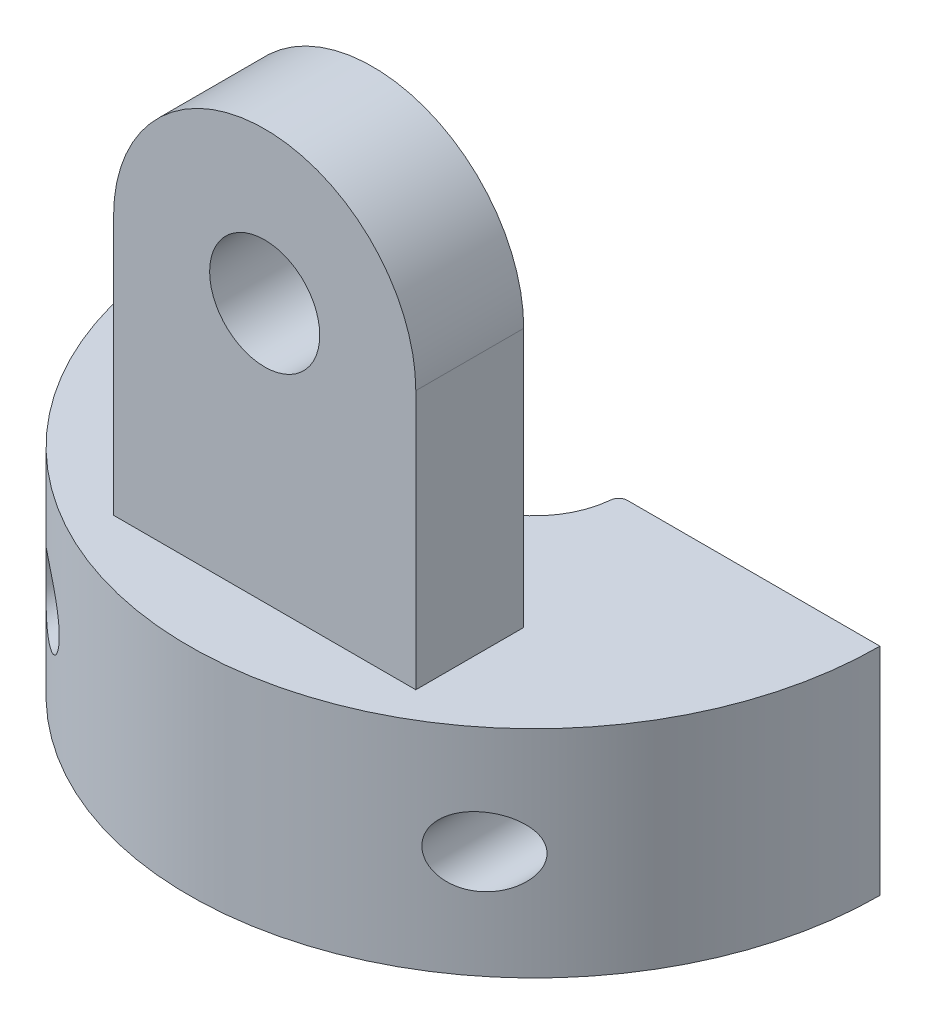
ISO-10303-21;
HEADER;
FILE_DESCRIPTION(('STEP AP214'),'2;1');
FILE_NAME('part.step','',(''),(''),'','','');
FILE_SCHEMA(('AUTOMOTIVE_DESIGN { 1 0 10303 214 1 1 1 1 }'));
ENDSEC;
DATA;
#1=APPLICATION_CONTEXT('core data for automotive mechanical design processes');
#2=APPLICATION_PROTOCOL_DEFINITION('international standard','automotive_design',2000,#1);
#3=PRODUCT_CONTEXT('',#1,'mechanical');
#4=PRODUCT('Part','Part','',(#3));
#5=PRODUCT_RELATED_PRODUCT_CATEGORY('part','',(#4));
#6=PRODUCT_DEFINITION_FORMATION('','',#4);
#7=PRODUCT_DEFINITION_CONTEXT('part definition',#1,'design');
#8=PRODUCT_DEFINITION('design','',#6,#7);
#9=PRODUCT_DEFINITION_SHAPE('','',#8);
#10=(LENGTH_UNIT() NAMED_UNIT(*) SI_UNIT(.MILLI.,.METRE.));
#11=(NAMED_UNIT(*) PLANE_ANGLE_UNIT() SI_UNIT($,.RADIAN.));
#12=(NAMED_UNIT(*) SI_UNIT($,.STERADIAN.) SOLID_ANGLE_UNIT());
#13=UNCERTAINTY_MEASURE_WITH_UNIT(LENGTH_MEASURE(1.E-05),#10,'distance_accuracy_value','');
#14=(GEOMETRIC_REPRESENTATION_CONTEXT(3) GLOBAL_UNCERTAINTY_ASSIGNED_CONTEXT((#13)) GLOBAL_UNIT_ASSIGNED_CONTEXT((#10,
#11,#12)) REPRESENTATION_CONTEXT('',''));
#15=CARTESIAN_POINT('',(0.,0.,0.));
#16=DIRECTION('',(0.,0.,1.));
#17=DIRECTION('',(1.,0.,0.));
#18=AXIS2_PLACEMENT_3D('',#15,#16,#17);
#19=CARTESIAN_POINT('',(3.5,12.,6.25));
#20=DIRECTION('',(0.,0.,1.));
#21=DIRECTION('',(1.,0.,0.));
#22=AXIS2_PLACEMENT_3D('',#19,#20,#21);
#23=PLANE('',#22);
#24=CARTESIAN_POINT('',(0.,8.5,6.25));
#25=DIRECTION('',(0.,0.,1.));
#26=DIRECTION('',(1.,0.,0.));
#27=AXIS2_PLACEMENT_3D('',#24,#25,#26);
#28=CIRCLE('',#27,1.275);
#29=CARTESIAN_POINT('',(1.275,8.5,6.25));
#30=VERTEX_POINT('',#29);
#31=EDGE_CURVE('E130',#30,#30,#28,.T.);
#32=ORIENTED_EDGE('',*,*,#31,.F.);
#33=EDGE_LOOP('',(#32));
#34=FACE_BOUND('',#33,.T.);
#35=DIRECTION('',(0.,-1.,0.));
#36=VECTOR('',#35,1.);
#37=CARTESIAN_POINT('',(3.5,12.,6.25));
#38=LINE('',#37,#36);
#39=CARTESIAN_POINT('',(3.5,8.5,6.25));
#40=VERTEX_POINT('',#39);
#41=CARTESIAN_POINT('',(3.5,2.5,6.25));
#42=VERTEX_POINT('',#41);
#43=EDGE_CURVE('E136',#40,#42,#38,.T.);
#44=ORIENTED_EDGE('',*,*,#43,.F.);
#45=CARTESIAN_POINT('',(0.,8.5,6.25));
#46=DIRECTION('',(0.,0.,1.));
#47=DIRECTION('',(1.,0.,0.));
#48=AXIS2_PLACEMENT_3D('',#45,#46,#47);
#49=CIRCLE('',#48,3.5);
#50=CARTESIAN_POINT('',(-3.5,8.5,6.25));
#51=VERTEX_POINT('',#50);
#52=EDGE_CURVE('E117',#40,#51,#49,.T.);
#53=ORIENTED_EDGE('',*,*,#52,.T.);
#54=DIRECTION('',(0.,-1.,0.));
#55=VECTOR('',#54,1.);
#56=CARTESIAN_POINT('',(-3.5,12.,6.25));
#57=LINE('',#56,#55);
#58=CARTESIAN_POINT('',(-3.5,2.5,6.25));
#59=VERTEX_POINT('',#58);
#60=EDGE_CURVE('E140',#51,#59,#57,.T.);
#61=ORIENTED_EDGE('',*,*,#60,.T.);
#62=DIRECTION('',(-1.,0.,0.));
#63=VECTOR('',#62,1.);
#64=CARTESIAN_POINT('',(3.5,2.5,6.25));
#65=LINE('',#64,#63);
#66=EDGE_CURVE('E285',#42,#59,#65,.T.);
#67=ORIENTED_EDGE('',*,*,#66,.F.);
#68=EDGE_LOOP('',(#44,#53,#61,#67));
#69=FACE_BOUND('',#68,.T.);
#70=ADVANCED_FACE('F34',(#34,#69),#23,.T.);
#71=CARTESIAN_POINT('',(3.5,12.,6.25));
#72=DIRECTION('',(-1.,0.,0.));
#73=DIRECTION('',(0.,0.,1.));
#74=AXIS2_PLACEMENT_3D('',#71,#72,#73);
#75=PLANE('',#74);
#76=DIRECTION('',(0.,0.,-1.));
#77=VECTOR('',#76,1.);
#78=CARTESIAN_POINT('',(3.5,8.5,13.25));
#79=LINE('',#78,#77);
#80=CARTESIAN_POINT('',(3.5,8.5,3.75));
#81=VERTEX_POINT('',#80);
#82=EDGE_CURVE('E111',#40,#81,#79,.T.);
#83=ORIENTED_EDGE('',*,*,#82,.F.);
#84=ORIENTED_EDGE('',*,*,#43,.T.);
#85=DIRECTION('',(0.,0.,-1.));
#86=VECTOR('',#85,1.);
#87=CARTESIAN_POINT('',(3.5,2.5,6.25));
#88=LINE('',#87,#86);
#89=CARTESIAN_POINT('',(3.5,2.5,3.75));
#90=VERTEX_POINT('',#89);
#91=EDGE_CURVE('E135',#42,#90,#88,.T.);
#92=ORIENTED_EDGE('',*,*,#91,.T.);
#93=DIRECTION('',(0.,-1.,0.));
#94=VECTOR('',#93,1.);
#95=CARTESIAN_POINT('',(3.5,12.,3.75));
#96=LINE('',#95,#94);
#97=EDGE_CURVE('E127',#81,#90,#96,.T.);
#98=ORIENTED_EDGE('',*,*,#97,.F.);
#99=EDGE_LOOP('',(#83,#84,#92,#98));
#100=FACE_BOUND('',#99,.T.);
#101=ADVANCED_FACE('F133',(#100),#75,.F.);
#102=CARTESIAN_POINT('',(3.5,12.,3.75));
#103=DIRECTION('',(0.,0.,1.));
#104=DIRECTION('',(1.,0.,0.));
#105=AXIS2_PLACEMENT_3D('',#102,#103,#104);
#106=PLANE('',#105);
#107=CARTESIAN_POINT('',(0.,8.5,3.75));
#108=DIRECTION('',(0.,0.,-1.));
#109=DIRECTION('',(-1.,0.,0.));
#110=AXIS2_PLACEMENT_3D('',#107,#108,#109);
#111=CIRCLE('',#110,1.275);
#112=CARTESIAN_POINT('',(-1.275,8.5,3.75));
#113=VERTEX_POINT('',#112);
#114=EDGE_CURVE('E177',#113,#113,#111,.T.);
#115=ORIENTED_EDGE('',*,*,#114,.F.);
#116=EDGE_LOOP('',(#115));
#117=FACE_BOUND('',#116,.T.);
#118=CARTESIAN_POINT('',(0.,8.5,3.75));
#119=DIRECTION('',(0.,0.,-1.));
#120=DIRECTION('',(-1.,0.,0.));
#121=AXIS2_PLACEMENT_3D('',#118,#119,#120);
#122=CIRCLE('',#121,3.5);
#123=CARTESIAN_POINT('',(-3.5,8.5,3.75));
#124=VERTEX_POINT('',#123);
#125=EDGE_CURVE('E115',#124,#81,#122,.T.);
#126=ORIENTED_EDGE('',*,*,#125,.T.);
#127=ORIENTED_EDGE('',*,*,#97,.T.);
#128=DIRECTION('',(-1.,0.,0.));
#129=VECTOR('',#128,1.);
#130=CARTESIAN_POINT('',(3.5,2.5,3.75));
#131=LINE('',#130,#129);
#132=CARTESIAN_POINT('',(-3.5,2.5,3.75));
#133=VERTEX_POINT('',#132);
#134=EDGE_CURVE('E291',#90,#133,#131,.T.);
#135=ORIENTED_EDGE('',*,*,#134,.T.);
#136=DIRECTION('',(0.,-1.,0.));
#137=VECTOR('',#136,1.);
#138=CARTESIAN_POINT('',(-3.5,12.,3.75));
#139=LINE('',#138,#137);
#140=EDGE_CURVE('E129',#124,#133,#139,.T.);
#141=ORIENTED_EDGE('',*,*,#140,.F.);
#142=EDGE_LOOP('',(#126,#127,#135,#141));
#143=FACE_BOUND('',#142,.T.);
#144=ADVANCED_FACE('F125',(#117,#143),#106,.F.);
#145=CARTESIAN_POINT('',(0.,2.5,0.));
#146=DIRECTION('',(0.,-1.,0.));
#147=DIRECTION('',(0.,0.,-1.));
#148=AXIS2_PLACEMENT_3D('',#145,#146,#147);
#149=CYLINDRICAL_SURFACE('',#148,1.96);
#150=CARTESIAN_POINT('',(0.,-2.5,0.));
#151=DIRECTION('',(0.,-1.,0.));
#152=DIRECTION('',(0.,0.,-1.));
#153=AXIS2_PLACEMENT_3D('',#150,#151,#152);
#154=CIRCLE('',#153,1.96);
#155=CARTESIAN_POINT('',(1.95157999371773,-2.5,0.181481481481481));
#156=VERTEX_POINT('',#155);
#157=CARTESIAN_POINT('',(-1.95157999371773,-2.5,0.181481481481481));
#158=VERTEX_POINT('',#157);
#159=EDGE_CURVE('E138',#156,#158,#154,.T.);
#160=ORIENTED_EDGE('',*,*,#159,.T.);
#161=DIRECTION('',(0.,-1.,0.));
#162=VECTOR('',#161,1.);
#163=CARTESIAN_POINT('',(-1.95157999371773,2.5,0.181481481481481));
#164=LINE('',#163,#162);
#165=CARTESIAN_POINT('',(-1.95157999371773,2.5,0.181481481481481));
#166=VERTEX_POINT('',#165);
#167=EDGE_CURVE('E55',#158,#166,#164,.F.);
#168=ORIENTED_EDGE('',*,*,#167,.T.);
#169=CARTESIAN_POINT('',(0.,2.5,0.));
#170=DIRECTION('',(0.,-1.,0.));
#171=DIRECTION('',(0.,0.,-1.));
#172=AXIS2_PLACEMENT_3D('',#169,#170,#171);
#173=CIRCLE('',#172,1.96);
#174=CARTESIAN_POINT('',(1.95157999371773,2.5,0.181481481481481));
#175=VERTEX_POINT('',#174);
#176=EDGE_CURVE('E145',#175,#166,#173,.T.);
#177=ORIENTED_EDGE('',*,*,#176,.F.);
#178=DIRECTION('',(0.,-1.,0.));
#179=VECTOR('',#178,1.);
#180=CARTESIAN_POINT('',(1.95157999371773,2.5,0.181481481481481));
#181=LINE('',#180,#179);
#182=EDGE_CURVE('E241',#175,#156,#181,.T.);
#183=ORIENTED_EDGE('',*,*,#182,.T.);
#184=EDGE_LOOP('',(#160,#168,#177,#183));
#185=FACE_BOUND('',#184,.T.);
#186=ADVANCED_FACE('F207',(#185),#149,.F.);
#187=CARTESIAN_POINT('',(-1.96,2.5,0.));
#188=DIRECTION('',(0.,0.,1.));
#189=DIRECTION('',(1.,0.,0.));
#190=AXIS2_PLACEMENT_3D('',#187,#188,#189);
#191=PLANE('',#190);
#192=CARTESIAN_POINT('',(-5.,0.,0.));
#193=DIRECTION('',(0.,0.,-1.));
#194=DIRECTION('',(-1.,0.,0.));
#195=AXIS2_PLACEMENT_3D('',#192,#193,#194);
#196=CIRCLE('',#195,0.799999999999999);
#197=CARTESIAN_POINT('',(-5.8,0.,0.));
#198=VERTEX_POINT('',#197);
#199=EDGE_CURVE('E178',#198,#198,#196,.T.);
#200=ORIENTED_EDGE('',*,*,#199,.F.);
#201=EDGE_LOOP('',(#200));
#202=FACE_BOUND('',#201,.T.);
#203=DIRECTION('',(-1.,0.,0.));
#204=VECTOR('',#203,1.);
#205=CARTESIAN_POINT('',(-1.96,2.5,0.));
#206=LINE('',#205,#204);
#207=CARTESIAN_POINT('',(-2.15072080940321,2.5,0.));
#208=VERTEX_POINT('',#207);
#209=CARTESIAN_POINT('',(-8.,2.5,0.));
#210=VERTEX_POINT('',#209);
#211=EDGE_CURVE('E147',#208,#210,#206,.T.);
#212=ORIENTED_EDGE('',*,*,#211,.F.);
#213=DIRECTION('',(0.,-1.,0.));
#214=VECTOR('',#213,1.);
#215=CARTESIAN_POINT('',(-2.15072080940321,2.5,0.));
#216=LINE('',#215,#214);
#217=CARTESIAN_POINT('',(-2.15072080940321,-2.5,0.));
#218=VERTEX_POINT('',#217);
#219=EDGE_CURVE('E168',#208,#218,#216,.T.);
#220=ORIENTED_EDGE('',*,*,#219,.T.);
#221=DIRECTION('',(-1.,0.,0.));
#222=VECTOR('',#221,1.);
#223=CARTESIAN_POINT('',(-1.96,-2.5,0.));
#224=LINE('',#223,#222);
#225=CARTESIAN_POINT('',(-8.,-2.5,0.));
#226=VERTEX_POINT('',#225);
#227=EDGE_CURVE('E157',#218,#226,#224,.T.);
#228=ORIENTED_EDGE('',*,*,#227,.T.);
#229=DIRECTION('',(0.,-1.,0.));
#230=VECTOR('',#229,1.);
#231=CARTESIAN_POINT('',(-8.,2.5,0.));
#232=LINE('',#231,#230);
#233=EDGE_CURVE('E165',#210,#226,#232,.T.);
#234=ORIENTED_EDGE('',*,*,#233,.F.);
#235=EDGE_LOOP('',(#212,#220,#228,#234));
#236=FACE_BOUND('',#235,.T.);
#237=ADVANCED_FACE('F228',(#202,#236),#191,.F.);
#238=CARTESIAN_POINT('',(0.,2.5,0.));
#239=DIRECTION('',(0.,-1.,0.));
#240=DIRECTION('',(0.,0.,-1.));
#241=AXIS2_PLACEMENT_3D('',#238,#239,#240);
#242=CYLINDRICAL_SURFACE('',#241,8.);
#243=CARTESIAN_POINT('',(4.2,0.,6.80881781221968));
#244=CARTESIAN_POINT('',(4.19999815658813,0.0398519375539786,6.80881874752186));
#245=CARTESIAN_POINT('',(4.20299070168571,0.0796936510163014,6.8069756681062));
#246=CARTESIAN_POINT('',(4.21478727328823,0.158158117485728,6.7996776298651));
#247=CARTESIAN_POINT('',(4.22359042597688,0.196781052861335,6.79422321412269));
#248=CARTESIAN_POINT('',(4.24651019872021,0.271628923056093,6.77992115743238));
#249=CARTESIAN_POINT('',(4.26061355340452,0.307859581301269,6.77108198682769));
#250=CARTESIAN_POINT('',(4.29345544547942,0.3771831476823,6.75030490819633));
#251=CARTESIAN_POINT('',(4.31219496341803,0.410275389992716,6.73836634462201));
#252=CARTESIAN_POINT('',(4.35450543851684,0.474210553880899,6.71110596120041));
#253=CARTESIAN_POINT('',(4.37826397170844,0.504871324546449,6.69565010494241));
#254=CARTESIAN_POINT('',(4.42907773478792,0.561696158657103,6.6621465721134));
#255=CARTESIAN_POINT('',(4.4561341027191,0.587858662253455,6.64409800044151));
#256=CARTESIAN_POINT('',(4.51656316341039,0.638793164596562,6.60319322188424));
#257=CARTESIAN_POINT('',(4.55029323854408,0.662882584040535,6.58001713954043));
#258=CARTESIAN_POINT('',(4.61980156941114,0.705056513787978,6.53140388253074));
#259=CARTESIAN_POINT('',(4.65558105668972,0.723137368049157,6.50596534311183));
#260=CARTESIAN_POINT('',(4.73471532012716,0.756156332538808,6.44866297984592));
#261=CARTESIAN_POINT('',(4.77829069655179,0.769973053391657,6.4164584851251));
#262=CARTESIAN_POINT('',(4.86585376369878,0.789952213298812,6.3503139197531));
#263=CARTESIAN_POINT('',(4.90984164405192,0.796110938674948,6.31637301534489));
#264=CARTESIAN_POINT('',(5.00544335465519,0.801665326593537,6.24098445427765));
#265=CARTESIAN_POINT('',(5.05696402421883,0.79960063425965,6.19930878626382));
#266=CARTESIAN_POINT('',(5.15824057209058,0.785860494832465,6.11530022446198));
#267=CARTESIAN_POINT('',(5.20799379872201,0.774171194742353,6.0729664696926));
#268=CARTESIAN_POINT('',(5.31091648898486,0.739359762024547,5.98325982899339));
#269=CARTESIAN_POINT('',(5.36370429897909,0.714962334998839,5.93593788085564));
#270=CARTESIAN_POINT('',(5.46417110489983,0.654206144462932,5.84358309029608));
#271=CARTESIAN_POINT('',(5.5118579576136,0.617866137754804,5.79854678531797));
#272=CARTESIAN_POINT('',(5.58423578633552,0.547921068401668,5.72868892716459));
#273=CARTESIAN_POINT('',(5.61105598994912,0.517976708158641,5.70239341170217));
#274=CARTESIAN_POINT('',(5.66083914587371,0.452735802526572,5.65297448542324));
#275=CARTESIAN_POINT('',(5.68380894754742,0.417448978229508,5.62984545557399));
#276=CARTESIAN_POINT('',(5.72013138845229,0.350043436918286,5.59290752424896));
#277=CARTESIAN_POINT('',(5.73448609387071,0.318978845122978,5.57817088409482));
#278=CARTESIAN_POINT('',(5.75943501785463,0.253908330320489,5.55240760398823));
#279=CARTESIAN_POINT('',(5.77003167378517,0.219904331596927,5.54137855963637));
#280=CARTESIAN_POINT('',(5.78679180136054,0.14928497444153,5.52387476991184));
#281=CARTESIAN_POINT('',(5.79291113445185,0.112647426546002,5.51744538248681));
#282=CARTESIAN_POINT('',(5.79994863533432,0.0383418519414037,5.51004763957584));
#283=CARTESIAN_POINT('',(5.80087216500529,0.000674927875699032,5.50907365431824));
#284=CARTESIAN_POINT('',(5.79769888747086,-0.0685037570937168,5.51241222283676));
#285=CARTESIAN_POINT('',(5.79433369049144,-0.100092002778029,5.51595440629535));
#286=CARTESIAN_POINT('',(5.78404934819513,-0.162028168005945,5.52673757576545));
#287=CARTESIAN_POINT('',(5.77712867276166,-0.192375547461649,5.53398015425168));
#288=CARTESIAN_POINT('',(5.75804851005671,-0.258499860525437,5.55383728681834));
#289=CARTESIAN_POINT('',(5.74501529008499,-0.293756003579797,5.56733879758455));
#290=CARTESIAN_POINT('',(5.71499740640622,-0.360738415603172,5.59814860781558));
#291=CARTESIAN_POINT('',(5.69800607021407,-0.392458588717965,5.61546333277194));
#292=CARTESIAN_POINT('',(5.65410649965383,-0.463085939740555,5.65971416715389));
#293=CARTESIAN_POINT('',(5.62584236015895,-0.500389864031218,5.68785521608543));
#294=CARTESIAN_POINT('',(5.56499040932441,-0.568215459687125,5.74740875017831));
#295=CARTESIAN_POINT('',(5.53239506335732,-0.598725058249408,5.7788269152972));
#296=CARTESIAN_POINT('',(5.45318497279639,-0.66175864313667,5.85376698178726));
#297=CARTESIAN_POINT('',(5.4053727770045,-0.691931406884803,5.89800256137496));
#298=CARTESIAN_POINT('',(5.3056469713107,-0.741404186505946,5.98787376217017));
#299=CARTESIAN_POINT('',(5.25373036093444,-0.760696162747686,6.03351039240693));
#300=CARTESIAN_POINT('',(5.14647198093169,-0.788445017474554,6.12526387804842));
#301=CARTESIAN_POINT('',(5.09109960104531,-0.796784213023055,6.17138066720966));
#302=CARTESIAN_POINT('',(4.97880399747824,-0.801688024707797,6.26232519771531));
#303=CARTESIAN_POINT('',(4.92188202226315,-0.79826185671176,6.30715392026407));
#304=CARTESIAN_POINT('',(4.81720292939666,-0.780347154439991,6.38734680033512));
#305=CARTESIAN_POINT('',(4.7694201485329,-0.767693908396838,6.42308651699252));
#306=CARTESIAN_POINT('',(4.67538048419636,-0.732890536898496,6.49185603190666));
#307=CARTESIAN_POINT('',(4.62912182186304,-0.710751937971945,6.52488906145815));
#308=CARTESIAN_POINT('',(4.54785540560439,-0.661369787494114,6.58171908485209));
#309=CARTESIAN_POINT('',(4.5123031664144,-0.635717534198905,6.60611707183476));
#310=CARTESIAN_POINT('',(4.44478131880778,-0.577677385096719,6.65173484790557));
#311=CARTESIAN_POINT('',(4.41281099841518,-0.545290831530873,6.6729552688799));
#312=CARTESIAN_POINT('',(4.35374537905656,-0.473834746600487,6.71164369469396));
#313=CARTESIAN_POINT('',(4.32669055111269,-0.434714483302282,6.72908075912679));
#314=CARTESIAN_POINT('',(4.27945072467692,-0.350879475964772,6.75922277977894));
#315=CARTESIAN_POINT('',(4.25925973322227,-0.306169659185623,6.77193186501779));
#316=CARTESIAN_POINT('',(4.22914142917108,-0.218333184609024,6.79077620742901));
#317=CARTESIAN_POINT('',(4.21827455362461,-0.175658131299035,6.797516449311));
#318=CARTESIAN_POINT('',(4.20370738027974,-0.0886503795811212,6.80653516508109));
#319=CARTESIAN_POINT('',(4.2000020500365,-0.0443188675187276,6.8088167720812));
#320=CARTESIAN_POINT('',(4.2,0.,6.80881781221968));
#321=B_SPLINE_CURVE_WITH_KNOTS('',3,(#243,#244,#245,#246,#247,#248,#249,#250,#251,#252,#253,
#254,#255,#256,#257,#258,#259,#260,#261,#262,#263,#264,#265,#266,#267,#268,#269,#270,#271,#272,
#273,#274,#275,#276,#277,#278,#279,#280,#281,#282,#283,#284,#285,#286,#287,#288,#289,#290,#291,
#292,#293,#294,#295,#296,#297,#298,#299,#300,#301,#302,#303,#304,#305,#306,#307,#308,#309,#310,
#311,#312,#313,#314,#315,#316,#317,#318,#319,#320),.UNSPECIFIED.,.T.,.F.,(4,2,2,2,2,2,2,2,2,2,2,
2,2,2,2,2,2,2,2,2,2,2,2,2,2,2,2,2,2,2,2,2,2,2,2,2,2,2,4),(0.,0.119386956410995,
0.238755963148914,0.357828180984911,0.476925604143475,0.601694361897775,0.726506298409561,
0.868432573671535,1.0104450496153,1.17757391630796,1.34478379911935,1.54289802657,
1.74129790548188,1.96517315359274,2.18869845435768,2.33237150944051,2.47578621250764,
2.58715295307343,2.69844733164416,2.81082461541598,2.92308590862406,3.01852364895732,
3.11400249581101,3.23316837705336,3.35253661754904,3.51547867809495,3.67870799946382,
3.89295859714682,4.10736729430324,4.32406136967572,4.54058574623285,4.72286533673009,
4.90492404791,5.05484084450981,5.20472778916783,5.35579781222864,5.50673559198264,
5.63959780827547,5.77236662779588),.UNSPECIFIED.);
#322=CARTESIAN_POINT('',(4.2,0.,6.80881781221968));
#323=VERTEX_POINT('',#322);
#324=EDGE_CURVE('E179',#323,#323,#321,.T.);
#325=ORIENTED_EDGE('',*,*,#324,.T.);
#326=EDGE_LOOP('',(#325));
#327=FACE_BOUND('',#326,.T.);
#328=CARTESIAN_POINT('',(-5.8,0.,5.50999092558236));
#329=CARTESIAN_POINT('',(-5.79999973358509,0.0355835805720054,5.50999124826604));
#330=CARTESIAN_POINT('',(-5.79760570697369,0.0711688542684127,5.5125145186994));
#331=CARTESIAN_POINT('',(-5.78825657518645,0.141059388361412,5.52233007609707));
#332=CARTESIAN_POINT('',(-5.78129776035944,0.175363583683178,5.52962624182094));
#333=CARTESIAN_POINT('',(-5.76345778785487,0.241446130887767,5.54821738352307));
#334=CARTESIAN_POINT('',(-5.75260786076298,0.273242202337872,5.55948050762745));
#335=CARTESIAN_POINT('',(-5.72763551496213,0.33411234882179,5.58520486413386));
#336=CARTESIAN_POINT('',(-5.71351139285339,0.363184995901577,5.59966776103823));
#337=CARTESIAN_POINT('',(-5.67540560747492,0.43124919694663,5.63833332650835));
#338=CARTESIAN_POINT('',(-5.64989105464832,0.468583150794455,5.66394128377098));
#339=CARTESIAN_POINT('',(-5.59457160287021,0.537057304568443,5.71859180840594));
#340=CARTESIAN_POINT('',(-5.56475655089598,0.568182419616093,5.74764247384825));
#341=CARTESIAN_POINT('',(-5.49118595937438,0.633977987668749,5.81809764546845));
#342=CARTESIAN_POINT('',(-5.44612846531558,0.666280398729729,5.86035450441284));
#343=CARTESIAN_POINT('',(-5.35177965424885,0.720565891945562,5.94664258446718));
#344=CARTESIAN_POINT('',(-5.30248626832814,0.742543897130304,5.99067466700208));
#345=CARTESIAN_POINT('',(-5.20009818086177,0.77647203497336,6.07977357327865));
#346=CARTESIAN_POINT('',(-5.14695875880767,0.788272298288977,6.12484614654851));
#347=CARTESIAN_POINT('',(-5.03869194465854,0.800920520662119,6.21421863764797));
#348=CARTESIAN_POINT('',(-4.98356348147957,0.801762487755128,6.25851811953458));
#349=CARTESIAN_POINT('',(-4.86938758415617,0.79146951180582,6.34780460741192));
#350=CARTESIAN_POINT('',(-4.8103056951263,0.779603136717774,6.39266960759626));
#351=CARTESIAN_POINT('',(-4.69396300000007,0.741662965507482,6.47857262918769));
#352=CARTESIAN_POINT('',(-4.63669815150724,0.715623447925527,6.51961960537207));
#353=CARTESIAN_POINT('',(-4.54564119505754,0.65983541586275,6.58324709631966));
#354=CARTESIAN_POINT('',(-4.51039918612075,0.634233078544581,6.6074153083986));
#355=CARTESIAN_POINT('',(-4.44347673786339,0.576396684069572,6.65260376952235));
#356=CARTESIAN_POINT('',(-4.41179437907718,0.544166227782096,6.67362571717406));
#357=CARTESIAN_POINT('',(-4.35324748055249,0.473123559868047,6.71196509357476));
#358=CARTESIAN_POINT('',(-4.32642297889707,0.434261363858143,6.72925194463207));
#359=CARTESIAN_POINT('',(-4.27954455421549,0.351024248730319,6.7591624485206));
#360=CARTESIAN_POINT('',(-4.25948488531075,0.306654052022607,6.77179005965528));
#361=CARTESIAN_POINT('',(-4.22973812824844,0.220219630065491,6.79040366263643));
#362=CARTESIAN_POINT('',(-4.21901555332227,0.178654261816224,6.79705664081389));
#363=CARTESIAN_POINT('',(-4.20436972317929,0.0939003552319894,6.80612609329367));
#364=CARTESIAN_POINT('',(-4.20044167440536,0.0507129832212249,6.80854555436807));
#365=CARTESIAN_POINT('',(-4.19966837505092,-0.0314891560182067,6.80902220456184));
#366=CARTESIAN_POINT('',(-4.20216594801705,-0.0704975310595007,6.80748414466458));
#367=CARTESIAN_POINT('',(-4.21274668225058,-0.147442897931287,6.80094138630309));
#368=CARTESIAN_POINT('',(-4.22082893718243,-0.185380062568346,6.79593725034649));
#369=CARTESIAN_POINT('',(-4.24207496112872,-0.258844721712143,6.782695142223));
#370=CARTESIAN_POINT('',(-4.2551960372975,-0.294389589163474,6.7744843298707));
#371=CARTESIAN_POINT('',(-4.28591559772556,-0.362607168053462,6.75509112688314));
#372=CARTESIAN_POINT('',(-4.30351500938852,-0.395279282695266,6.74390812072473));
#373=CARTESIAN_POINT('',(-4.34383691341752,-0.459325705342622,6.71801250884323));
#374=CARTESIAN_POINT('',(-4.36683114066248,-0.490450490644214,6.70310810315783));
#375=CARTESIAN_POINT('',(-4.41621696428757,-0.548312276697212,6.67067468208536));
#376=CARTESIAN_POINT('',(-4.44260995776471,-0.575047462720699,6.65314458689614));
#377=CARTESIAN_POINT('',(-4.50157500164994,-0.627149711006334,6.61341388755191));
#378=CARTESIAN_POINT('',(-4.53450323432731,-0.651874890232797,6.59090224869427));
#379=CARTESIAN_POINT('',(-4.60251798276003,-0.695443788911803,6.5435883498285));
#380=CARTESIAN_POINT('',(-4.63760572379955,-0.714284131844135,6.51878478532728));
#381=CARTESIAN_POINT('',(-4.71527487483957,-0.749028199820446,6.4628823516191));
#382=CARTESIAN_POINT('',(-4.75809499933907,-0.763844791121631,6.43144047512458));
#383=CARTESIAN_POINT('',(-4.84429726466845,-0.785964258801264,6.36676497784262));
#384=CARTESIAN_POINT('',(-4.88767968025762,-0.79326330995545,6.3335304539268));
#385=CARTESIAN_POINT('',(-4.98217108191166,-0.801454938606386,6.25956874391525));
#386=CARTESIAN_POINT('',(-5.03321605345837,-0.800903070299313,6.21859787713727));
#387=CARTESIAN_POINT('',(-5.13374057013211,-0.790362305047729,6.13587471551614));
#388=CARTESIAN_POINT('',(-5.18321797694845,-0.780361046521654,6.09412146731082));
#389=CARTESIAN_POINT('',(-5.28619130638612,-0.749247706590643,6.00511582618944));
#390=CARTESIAN_POINT('',(-5.33931391566532,-0.726805374427412,5.95789073542791));
#391=CARTESIAN_POINT('',(-5.44077652493994,-0.670140905247464,5.86537658525044));
#392=CARTESIAN_POINT('',(-5.48912197235412,-0.635932389554335,5.82008535492431));
#393=CARTESIAN_POINT('',(-5.56426933825932,-0.568543713060423,5.74810137094313));
#394=CARTESIAN_POINT('',(-5.59292812806937,-0.538723780085801,5.72018989326539));
#395=CARTESIAN_POINT('',(-5.64631458116874,-0.473342188039791,5.6674974646057));
#396=CARTESIAN_POINT('',(-5.67104918358619,-0.437790893401187,5.6427110039738));
#397=CARTESIAN_POINT('',(-5.71011148341159,-0.369986821652554,5.60314306834854));
#398=CARTESIAN_POINT('',(-5.72551780214544,-0.338933418243957,5.5873806423862));
#399=CARTESIAN_POINT('',(-5.7525606760845,-0.273670874558833,5.55953437688915));
#400=CARTESIAN_POINT('',(-5.76420097678789,-0.239464913448487,5.54744688317178));
#401=CARTESIAN_POINT('',(-5.78212800979315,-0.17148054598356,5.52875678703121));
#402=CARTESIAN_POINT('',(-5.78877968299074,-0.137903504549602,5.52178141154354));
#403=CARTESIAN_POINT('',(-5.79771414827513,-0.0695508936137936,5.51240005932564));
#404=CARTESIAN_POINT('',(-5.80000026037045,-0.0347762553910272,5.50999061021978));
#405=CARTESIAN_POINT('',(-5.8,0.,5.50999092558236));
#406=B_SPLINE_CURVE_WITH_KNOTS('',3,(#328,#329,#330,#331,#332,#333,#334,#335,#336,#337,#338,
#339,#340,#341,#342,#343,#344,#345,#346,#347,#348,#349,#350,#351,#352,#353,#354,#355,#356,#357,
#358,#359,#360,#361,#362,#363,#364,#365,#366,#367,#368,#369,#370,#371,#372,#373,#374,#375,#376,
#377,#378,#379,#380,#381,#382,#383,#384,#385,#386,#387,#388,#389,#390,#391,#392,#393,#394,#395,
#396,#397,#398,#399,#400,#401,#402,#403,#404,#405),.UNSPECIFIED.,.T.,.F.,(4,2,2,2,2,2,2,2,2,2,2,
2,2,2,2,2,2,2,2,2,2,2,2,2,2,2,2,2,2,2,2,2,2,2,2,2,2,2,4),(0.,0.106594223265779,0.2132751795996,
0.319118389438811,0.425016788274055,0.580056688604109,0.735468802088834,0.943503458805495,
1.15164030861527,1.36279210440237,1.57405935252996,1.7981738086664,2.02174862447207,
2.17062288767615,2.31941648436478,2.46938555093108,2.61922691482219,2.7488162251249,
2.87831407246221,2.99510498128706,3.11187694061724,3.2276805996096,3.34350825954311,
3.46741586423834,3.59137456596085,3.73162886646125,3.87196349294204,4.03680127360103,
4.20172288892017,4.39732577758954,4.59318490648068,4.81577809095763,5.03811444914369,
5.18734570714471,5.33631006581448,5.45014360911507,5.56386358858629,5.66811870504593,
5.77229450388095),.UNSPECIFIED.);
#407=CARTESIAN_POINT('',(-5.8,0.,5.50999092558236));
#408=VERTEX_POINT('',#407);
#409=EDGE_CURVE('E169',#408,#408,#406,.T.);
#410=ORIENTED_EDGE('',*,*,#409,.T.);
#411=EDGE_LOOP('',(#410));
#412=FACE_BOUND('',#411,.T.);
#413=CARTESIAN_POINT('',(0.,-2.5,0.));
#414=DIRECTION('',(0.,1.,0.));
#415=DIRECTION('',(0.,0.,1.));
#416=AXIS2_PLACEMENT_3D('',#413,#414,#415);
#417=CIRCLE('',#416,8.);
#418=CARTESIAN_POINT('',(8.,-2.5,0.));
#419=VERTEX_POINT('',#418);
#420=EDGE_CURVE('E159',#226,#419,#417,.T.);
#421=ORIENTED_EDGE('',*,*,#420,.T.);
#422=DIRECTION('',(0.,-1.,0.));
#423=VECTOR('',#422,1.);
#424=CARTESIAN_POINT('',(8.,2.5,0.));
#425=LINE('',#424,#423);
#426=CARTESIAN_POINT('',(8.,2.5,0.));
#427=VERTEX_POINT('',#426);
#428=EDGE_CURVE('E155',#427,#419,#425,.T.);
#429=ORIENTED_EDGE('',*,*,#428,.F.);
#430=CARTESIAN_POINT('',(0.,2.5,0.));
#431=DIRECTION('',(0.,1.,0.));
#432=DIRECTION('',(0.,0.,1.));
#433=AXIS2_PLACEMENT_3D('',#430,#431,#432);
#434=CIRCLE('',#433,8.);
#435=EDGE_CURVE('E150',#210,#427,#434,.T.);
#436=ORIENTED_EDGE('',*,*,#435,.F.);
#437=ORIENTED_EDGE('',*,*,#233,.T.);
#438=EDGE_LOOP('',(#421,#429,#436,#437));
#439=FACE_BOUND('',#438,.T.);
#440=ADVANCED_FACE('F185',(#327,#412,#439),#242,.T.);
#441=CARTESIAN_POINT('',(1.96,2.5,0.));
#442=DIRECTION('',(0.,0.,-1.));
#443=DIRECTION('',(-1.,0.,0.));
#444=AXIS2_PLACEMENT_3D('',#441,#442,#443);
#445=PLANE('',#444);
#446=CARTESIAN_POINT('',(5.,0.,0.));
#447=DIRECTION('',(0.,0.,-1.));
#448=DIRECTION('',(-1.,0.,0.));
#449=AXIS2_PLACEMENT_3D('',#446,#447,#448);
#450=CIRCLE('',#449,0.799999999999999);
#451=CARTESIAN_POINT('',(4.2,0.,0.));
#452=VERTEX_POINT('',#451);
#453=EDGE_CURVE('E232',#452,#452,#450,.T.);
#454=ORIENTED_EDGE('',*,*,#453,.F.);
#455=EDGE_LOOP('',(#454));
#456=FACE_BOUND('',#455,.T.);
#457=DIRECTION('',(1.,0.,0.));
#458=VECTOR('',#457,1.);
#459=CARTESIAN_POINT('',(1.96,-2.5,0.));
#460=LINE('',#459,#458);
#461=CARTESIAN_POINT('',(2.15072080940321,-2.5,0.));
#462=VERTEX_POINT('',#461);
#463=EDGE_CURVE('E148',#462,#419,#460,.T.);
#464=ORIENTED_EDGE('',*,*,#463,.F.);
#465=DIRECTION('',(0.,1.,0.));
#466=VECTOR('',#465,1.);
#467=CARTESIAN_POINT('',(2.15072080940321,2.5,0.));
#468=LINE('',#467,#466);
#469=CARTESIAN_POINT('',(2.15072080940321,2.5,0.));
#470=VERTEX_POINT('',#469);
#471=EDGE_CURVE('E11',#462,#470,#468,.T.);
#472=ORIENTED_EDGE('',*,*,#471,.T.);
#473=DIRECTION('',(1.,0.,0.));
#474=VECTOR('',#473,1.);
#475=CARTESIAN_POINT('',(1.96,2.5,0.));
#476=LINE('',#475,#474);
#477=EDGE_CURVE('E153',#470,#427,#476,.T.);
#478=ORIENTED_EDGE('',*,*,#477,.T.);
#479=ORIENTED_EDGE('',*,*,#428,.T.);
#480=EDGE_LOOP('',(#464,#472,#478,#479));
#481=FACE_BOUND('',#480,.T.);
#482=ADVANCED_FACE('F219',(#456,#481),#445,.T.);
#483=CARTESIAN_POINT('',(0.,2.5,0.));
#484=DIRECTION('',(0.,-1.,0.));
#485=DIRECTION('',(0.,0.,-1.));
#486=AXIS2_PLACEMENT_3D('',#483,#484,#485);
#487=PLANE('',#486);
#488=ORIENTED_EDGE('',*,*,#91,.F.);
#489=ORIENTED_EDGE('',*,*,#66,.T.);
#490=DIRECTION('',(0.,0.,1.));
#491=VECTOR('',#490,1.);
#492=CARTESIAN_POINT('',(-3.5,2.5,3.75));
#493=LINE('',#492,#491);
#494=EDGE_CURVE('E288',#133,#59,#493,.T.);
#495=ORIENTED_EDGE('',*,*,#494,.F.);
#496=ORIENTED_EDGE('',*,*,#134,.F.);
#497=EDGE_LOOP('',(#488,#489,#495,#496));
#498=FACE_BOUND('',#497,.T.);
#499=ORIENTED_EDGE('',*,*,#176,.T.);
#500=CARTESIAN_POINT('',(-2.15072080940321,2.5,0.2));
#501=DIRECTION('',(0.,-1.,0.));
#502=DIRECTION('',(0.,0.,-1.));
#503=AXIS2_PLACEMENT_3D('',#500,#501,#502);
#504=CIRCLE('',#503,0.2);
#505=EDGE_CURVE('E42',#166,#208,#504,.F.);
#506=ORIENTED_EDGE('',*,*,#505,.T.);
#507=ORIENTED_EDGE('',*,*,#211,.T.);
#508=ORIENTED_EDGE('',*,*,#435,.T.);
#509=ORIENTED_EDGE('',*,*,#477,.F.);
#510=CARTESIAN_POINT('',(2.15072080940321,2.5,0.2));
#511=DIRECTION('',(0.,-1.,0.));
#512=DIRECTION('',(0.,0.,-1.));
#513=AXIS2_PLACEMENT_3D('',#510,#511,#512);
#514=CIRCLE('',#513,0.2);
#515=EDGE_CURVE('E240',#470,#175,#514,.F.);
#516=ORIENTED_EDGE('',*,*,#515,.T.);
#517=EDGE_LOOP('',(#499,#506,#507,#508,#509,#516));
#518=FACE_BOUND('',#517,.T.);
#519=ADVANCED_FACE('F216',(#498,#518),#487,.F.);
#520=CARTESIAN_POINT('',(0.,-2.5,0.));
#521=DIRECTION('',(0.,-1.,0.));
#522=DIRECTION('',(0.,0.,-1.));
#523=AXIS2_PLACEMENT_3D('',#520,#521,#522);
#524=PLANE('',#523);
#525=ORIENTED_EDGE('',*,*,#227,.F.);
#526=CARTESIAN_POINT('',(-2.15072080940321,-2.5,0.2));
#527=DIRECTION('',(0.,-1.,0.));
#528=DIRECTION('',(0.,0.,-1.));
#529=AXIS2_PLACEMENT_3D('',#526,#527,#528);
#530=CIRCLE('',#529,0.2);
#531=EDGE_CURVE('E247',#218,#158,#530,.T.);
#532=ORIENTED_EDGE('',*,*,#531,.T.);
#533=ORIENTED_EDGE('',*,*,#159,.F.);
#534=CARTESIAN_POINT('',(2.15072080940321,-2.5,0.2));
#535=DIRECTION('',(0.,-1.,0.));
#536=DIRECTION('',(0.,0.,-1.));
#537=AXIS2_PLACEMENT_3D('',#534,#535,#536);
#538=CIRCLE('',#537,0.2);
#539=EDGE_CURVE('E238',#156,#462,#538,.T.);
#540=ORIENTED_EDGE('',*,*,#539,.T.);
#541=ORIENTED_EDGE('',*,*,#463,.T.);
#542=ORIENTED_EDGE('',*,*,#420,.F.);
#543=EDGE_LOOP('',(#525,#532,#533,#540,#541,#542));
#544=FACE_BOUND('',#543,.T.);
#545=ADVANCED_FACE('F211',(#544),#524,.T.);
#546=CARTESIAN_POINT('',(-3.5,12.,3.75));
#547=DIRECTION('',(1.,0.,0.));
#548=DIRECTION('',(0.,0.,-1.));
#549=AXIS2_PLACEMENT_3D('',#546,#547,#548);
#550=PLANE('',#549);
#551=ORIENTED_EDGE('',*,*,#60,.F.);
#552=DIRECTION('',(0.,0.,-1.));
#553=VECTOR('',#552,1.);
#554=CARTESIAN_POINT('',(-3.5,8.5,13.25));
#555=LINE('',#554,#553);
#556=EDGE_CURVE('E121',#51,#124,#555,.T.);
#557=ORIENTED_EDGE('',*,*,#556,.T.);
#558=ORIENTED_EDGE('',*,*,#140,.T.);
#559=ORIENTED_EDGE('',*,*,#494,.T.);
#560=EDGE_LOOP('',(#551,#557,#558,#559));
#561=FACE_BOUND('',#560,.T.);
#562=ADVANCED_FACE('F202',(#561),#550,.F.);
#563=CARTESIAN_POINT('',(0.,8.5,13.25));
#564=DIRECTION('',(0.,0.,-1.));
#565=DIRECTION('',(-1.,0.,0.));
#566=AXIS2_PLACEMENT_3D('',#563,#564,#565);
#567=CYLINDRICAL_SURFACE('',#566,3.5);
#568=ORIENTED_EDGE('',*,*,#82,.T.);
#569=ORIENTED_EDGE('',*,*,#125,.F.);
#570=ORIENTED_EDGE('',*,*,#556,.F.);
#571=ORIENTED_EDGE('',*,*,#52,.F.);
#572=EDGE_LOOP('',(#568,#569,#570,#571));
#573=FACE_BOUND('',#572,.T.);
#574=ADVANCED_FACE('F113',(#573),#567,.T.);
#575=CARTESIAN_POINT('',(0.,8.5,13.25));
#576=DIRECTION('',(0.,0.,-1.));
#577=DIRECTION('',(-1.,0.,0.));
#578=AXIS2_PLACEMENT_3D('',#575,#576,#577);
#579=CYLINDRICAL_SURFACE('',#578,1.275);
#580=ORIENTED_EDGE('',*,*,#31,.T.);
#581=EDGE_LOOP('',(#580));
#582=FACE_BOUND('',#581,.T.);
#583=ORIENTED_EDGE('',*,*,#114,.T.);
#584=EDGE_LOOP('',(#583));
#585=FACE_BOUND('',#584,.T.);
#586=ADVANCED_FACE('F194',(#582,#585),#579,.F.);
#587=CARTESIAN_POINT('',(-5.,0.,0.));
#588=DIRECTION('',(0.,0.,-1.));
#589=DIRECTION('',(-1.,0.,0.));
#590=AXIS2_PLACEMENT_3D('',#587,#588,#589);
#591=CYLINDRICAL_SURFACE('',#590,0.799999999999999);
#592=ORIENTED_EDGE('',*,*,#199,.T.);
#593=EDGE_LOOP('',(#592));
#594=FACE_BOUND('',#593,.T.);
#595=ORIENTED_EDGE('',*,*,#409,.F.);
#596=EDGE_LOOP('',(#595));
#597=FACE_BOUND('',#596,.T.);
#598=ADVANCED_FACE('F189',(#594,#597),#591,.F.);
#599=CARTESIAN_POINT('',(5.,0.,0.));
#600=DIRECTION('',(0.,0.,-1.));
#601=DIRECTION('',(-1.,0.,0.));
#602=AXIS2_PLACEMENT_3D('',#599,#600,#601);
#603=CYLINDRICAL_SURFACE('',#602,0.799999999999999);
#604=ORIENTED_EDGE('',*,*,#453,.T.);
#605=EDGE_LOOP('',(#604));
#606=FACE_BOUND('',#605,.T.);
#607=ORIENTED_EDGE('',*,*,#324,.F.);
#608=EDGE_LOOP('',(#607));
#609=FACE_BOUND('',#608,.T.);
#610=ADVANCED_FACE('F193',(#606,#609),#603,.F.);
#611=CARTESIAN_POINT('',(-2.15072080940321,2.5,0.2));
#612=DIRECTION('',(0.,-1.,0.));
#613=DIRECTION('',(0.,0.,-1.));
#614=AXIS2_PLACEMENT_3D('',#611,#612,#613);
#615=CYLINDRICAL_SURFACE('',#614,0.2);
#616=ORIENTED_EDGE('',*,*,#505,.F.);
#617=ORIENTED_EDGE('',*,*,#167,.F.);
#618=ORIENTED_EDGE('',*,*,#531,.F.);
#619=ORIENTED_EDGE('',*,*,#219,.F.);
#620=EDGE_LOOP('',(#616,#617,#618,#619));
#621=FACE_BOUND('',#620,.T.);
#622=ADVANCED_FACE('F260',(#621),#615,.T.);
#623=CARTESIAN_POINT('',(2.15072080940321,2.5,0.2));
#624=DIRECTION('',(0.,-1.,0.));
#625=DIRECTION('',(0.,0.,-1.));
#626=AXIS2_PLACEMENT_3D('',#623,#624,#625);
#627=CYLINDRICAL_SURFACE('',#626,0.2);
#628=ORIENTED_EDGE('',*,*,#515,.F.);
#629=ORIENTED_EDGE('',*,*,#471,.F.);
#630=ORIENTED_EDGE('',*,*,#539,.F.);
#631=ORIENTED_EDGE('',*,*,#182,.F.);
#632=EDGE_LOOP('',(#628,#629,#630,#631));
#633=FACE_BOUND('',#632,.T.);
#634=ADVANCED_FACE('F36',(#633),#627,.T.);
#635=CLOSED_SHELL('',(#70,#101,#144,#186,#237,#440,#482,#519,#545,#562,#574,#586,#598,#610,#622,#634));
#636=MANIFOLD_SOLID_BREP('B2',#635);
#637=ADVANCED_BREP_SHAPE_REPRESENTATION('',(#18,#636),#14);
#638=SHAPE_DEFINITION_REPRESENTATION(#9,#637);
ENDSEC;
END-ISO-10303-21;
